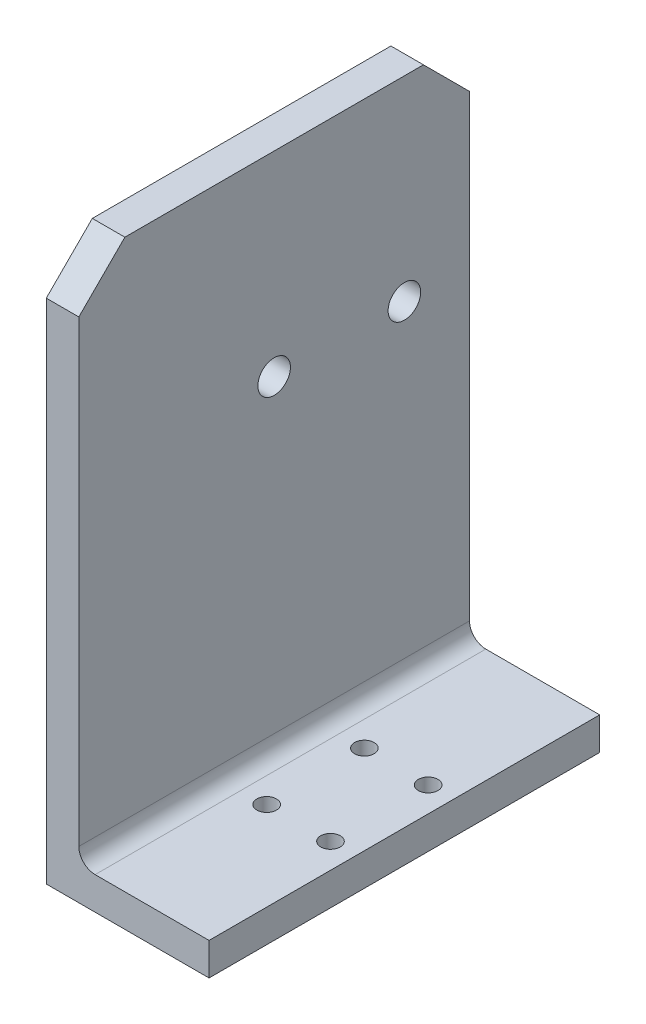
ISO-10303-21;
HEADER;
FILE_DESCRIPTION(('STEP AP214'),'2;1');
FILE_NAME('part.step','',(''),(''),'','','');
FILE_SCHEMA(('AUTOMOTIVE_DESIGN { 1 0 10303 214 1 1 1 1 }'));
ENDSEC;
DATA;
#1=APPLICATION_CONTEXT('core data for automotive mechanical design processes');
#2=APPLICATION_PROTOCOL_DEFINITION('international standard','automotive_design',2000,#1);
#3=PRODUCT_CONTEXT('',#1,'mechanical');
#4=PRODUCT('Part','Part','',(#3));
#5=PRODUCT_RELATED_PRODUCT_CATEGORY('part','',(#4));
#6=PRODUCT_DEFINITION_FORMATION('','',#4);
#7=PRODUCT_DEFINITION_CONTEXT('part definition',#1,'design');
#8=PRODUCT_DEFINITION('design','',#6,#7);
#9=PRODUCT_DEFINITION_SHAPE('','',#8);
#10=(LENGTH_UNIT() NAMED_UNIT(*) SI_UNIT(.MILLI.,.METRE.));
#11=(NAMED_UNIT(*) PLANE_ANGLE_UNIT() SI_UNIT($,.RADIAN.));
#12=(NAMED_UNIT(*) SI_UNIT($,.STERADIAN.) SOLID_ANGLE_UNIT());
#13=UNCERTAINTY_MEASURE_WITH_UNIT(LENGTH_MEASURE(1.E-05),#10,'distance_accuracy_value','');
#14=(GEOMETRIC_REPRESENTATION_CONTEXT(3) GLOBAL_UNCERTAINTY_ASSIGNED_CONTEXT((#13)) GLOBAL_UNIT_ASSIGNED_CONTEXT((#10,
#11,#12)) REPRESENTATION_CONTEXT('',''));
#15=CARTESIAN_POINT('',(0.,0.,0.));
#16=DIRECTION('',(0.,0.,1.));
#17=DIRECTION('',(1.,0.,0.));
#18=AXIS2_PLACEMENT_3D('',#15,#16,#17);
#19=CARTESIAN_POINT('',(12.5,5.,-30.));
#20=DIRECTION('',(-1.,0.,0.));
#21=DIRECTION('',(0.,0.,1.));
#22=AXIS2_PLACEMENT_3D('',#19,#20,#21);
#23=PLANE('',#22);
#24=DIRECTION('',(0.,0.,-1.));
#25=VECTOR('',#24,1.);
#26=CARTESIAN_POINT('',(12.5,0.,-30.));
#27=LINE('',#26,#25);
#28=CARTESIAN_POINT('',(12.5,0.,30.));
#29=VERTEX_POINT('',#28);
#30=CARTESIAN_POINT('',(12.5,0.,-30.));
#31=VERTEX_POINT('',#30);
#32=EDGE_CURVE('E126',#29,#31,#27,.T.);
#33=ORIENTED_EDGE('',*,*,#32,.T.);
#34=DIRECTION('',(0.,-1.,0.));
#35=VECTOR('',#34,1.);
#36=CARTESIAN_POINT('',(12.5,5.,-30.));
#37=LINE('',#36,#35);
#38=CARTESIAN_POINT('',(12.5,5.,-30.));
#39=VERTEX_POINT('',#38);
#40=EDGE_CURVE('E156',#39,#31,#37,.T.);
#41=ORIENTED_EDGE('',*,*,#40,.F.);
#42=DIRECTION('',(0.,0.,-1.));
#43=VECTOR('',#42,1.);
#44=CARTESIAN_POINT('',(12.5,5.,-30.));
#45=LINE('',#44,#43);
#46=CARTESIAN_POINT('',(12.5,5.,30.));
#47=VERTEX_POINT('',#46);
#48=EDGE_CURVE('E135',#47,#39,#45,.T.);
#49=ORIENTED_EDGE('',*,*,#48,.F.);
#50=DIRECTION('',(0.,-1.,0.));
#51=VECTOR('',#50,1.);
#52=CARTESIAN_POINT('',(12.5,5.,30.));
#53=LINE('',#52,#51);
#54=EDGE_CURVE('E142',#47,#29,#53,.T.);
#55=ORIENTED_EDGE('',*,*,#54,.T.);
#56=EDGE_LOOP('',(#33,#41,#49,#55));
#57=FACE_BOUND('',#56,.T.);
#58=ADVANCED_FACE('F33',(#57),#23,.F.);
#59=CARTESIAN_POINT('',(-12.5,5.,-30.));
#60=DIRECTION('',(0.,0.,1.));
#61=DIRECTION('',(1.,0.,0.));
#62=AXIS2_PLACEMENT_3D('',#59,#60,#61);
#63=PLANE('',#62);
#64=DIRECTION('',(0.,-1.,0.));
#65=VECTOR('',#64,1.);
#66=CARTESIAN_POINT('',(-12.5,5.,-30.));
#67=LINE('',#66,#65);
#68=CARTESIAN_POINT('',(-12.5,77.9289321881345,-30.));
#69=VERTEX_POINT('',#68);
#70=CARTESIAN_POINT('',(-12.5,0.,-30.));
#71=VERTEX_POINT('',#70);
#72=EDGE_CURVE('E154',#69,#71,#67,.T.);
#73=ORIENTED_EDGE('',*,*,#72,.F.);
#74=DIRECTION('',(1.,0.,0.));
#75=VECTOR('',#74,1.);
#76=CARTESIAN_POINT('',(-12.501,77.9289321881345,-30.));
#77=LINE('',#76,#75);
#78=CARTESIAN_POINT('',(-7.5,77.9289321881345,-30.));
#79=VERTEX_POINT('',#78);
#80=EDGE_CURVE('E166',#69,#79,#77,.T.);
#81=ORIENTED_EDGE('',*,*,#80,.T.);
#82=DIRECTION('',(0.,-1.,0.));
#83=VECTOR('',#82,1.);
#84=CARTESIAN_POINT('',(-7.5,85.,-30.));
#85=LINE('',#84,#83);
#86=CARTESIAN_POINT('',(-7.5,7.49999999999999,-30.));
#87=VERTEX_POINT('',#86);
#88=EDGE_CURVE('E127',#79,#87,#85,.T.);
#89=ORIENTED_EDGE('',*,*,#88,.T.);
#90=CARTESIAN_POINT('',(-5.,7.49999999999999,-30.));
#91=DIRECTION('',(0.,0.,1.));
#92=DIRECTION('',(1.,0.,0.));
#93=AXIS2_PLACEMENT_3D('',#90,#91,#92);
#94=CIRCLE('',#93,2.5);
#95=CARTESIAN_POINT('',(-5.,5.,-30.));
#96=VERTEX_POINT('',#95);
#97=EDGE_CURVE('E41',#87,#96,#94,.T.);
#98=ORIENTED_EDGE('',*,*,#97,.T.);
#99=DIRECTION('',(-1.,0.,0.));
#100=VECTOR('',#99,1.);
#101=CARTESIAN_POINT('',(-12.5,5.,-30.));
#102=LINE('',#101,#100);
#103=EDGE_CURVE('E138',#39,#96,#102,.T.);
#104=ORIENTED_EDGE('',*,*,#103,.F.);
#105=ORIENTED_EDGE('',*,*,#40,.T.);
#106=DIRECTION('',(-1.,0.,0.));
#107=VECTOR('',#106,1.);
#108=CARTESIAN_POINT('',(-12.5,0.,-30.));
#109=LINE('',#108,#107);
#110=EDGE_CURVE('E130',#31,#71,#109,.T.);
#111=ORIENTED_EDGE('',*,*,#110,.T.);
#112=EDGE_LOOP('',(#73,#81,#89,#98,#104,#105,#111));
#113=FACE_BOUND('',#112,.T.);
#114=ADVANCED_FACE('F165',(#113),#63,.F.);
#115=CARTESIAN_POINT('',(-12.5,5.,-30.));
#116=DIRECTION('',(1.,0.,0.));
#117=DIRECTION('',(0.,0.,-1.));
#118=AXIS2_PLACEMENT_3D('',#115,#116,#117);
#119=PLANE('',#118);
#120=CARTESIAN_POINT('',(-12.5,55.,-20.));
#121=DIRECTION('',(1.,0.,0.));
#122=DIRECTION('',(0.,0.,1.));
#123=AXIS2_PLACEMENT_3D('',#120,#121,#122);
#124=CIRCLE('',#123,2.5);
#125=CARTESIAN_POINT('',(-12.5,55.,-17.5));
#126=VERTEX_POINT('',#125);
#127=EDGE_CURVE('E216',#126,#126,#124,.T.);
#128=ORIENTED_EDGE('',*,*,#127,.T.);
#129=EDGE_LOOP('',(#128));
#130=FACE_BOUND('',#129,.T.);
#131=CARTESIAN_POINT('',(-12.5,55.,0.));
#132=DIRECTION('',(1.,0.,0.));
#133=DIRECTION('',(0.,0.,-1.));
#134=AXIS2_PLACEMENT_3D('',#131,#132,#133);
#135=CIRCLE('',#134,2.5);
#136=CARTESIAN_POINT('',(-12.5,55.,-2.5));
#137=VERTEX_POINT('',#136);
#138=EDGE_CURVE('E180',#137,#137,#135,.F.);
#139=ORIENTED_EDGE('',*,*,#138,.F.);
#140=EDGE_LOOP('',(#139));
#141=FACE_BOUND('',#140,.T.);
#142=DIRECTION('',(0.,-1.,0.));
#143=VECTOR('',#142,1.);
#144=CARTESIAN_POINT('',(-12.5,5.,30.));
#145=LINE('',#144,#143);
#146=CARTESIAN_POINT('',(-12.5,77.9289321881345,30.));
#147=VERTEX_POINT('',#146);
#148=CARTESIAN_POINT('',(-12.5,0.,30.));
#149=VERTEX_POINT('',#148);
#150=EDGE_CURVE('E152',#147,#149,#145,.T.);
#151=ORIENTED_EDGE('',*,*,#150,.F.);
#152=DIRECTION('',(0.,-0.707106781186551,0.707106781186544));
#153=VECTOR('',#152,1.);
#154=CARTESIAN_POINT('',(-12.5,77.9289321881345,30.));
#155=LINE('',#154,#153);
#156=CARTESIAN_POINT('',(-12.5,85.,22.9289321881346));
#157=VERTEX_POINT('',#156);
#158=EDGE_CURVE('E107',#157,#147,#155,.T.);
#159=ORIENTED_EDGE('',*,*,#158,.F.);
#160=DIRECTION('',(0.,0.,1.));
#161=VECTOR('',#160,1.);
#162=CARTESIAN_POINT('',(-12.5,85.,-30.));
#163=LINE('',#162,#161);
#164=CARTESIAN_POINT('',(-12.5,85.,-22.9289321881345));
#165=VERTEX_POINT('',#164);
#166=EDGE_CURVE('E183',#165,#157,#163,.T.);
#167=ORIENTED_EDGE('',*,*,#166,.F.);
#168=DIRECTION('',(0.,0.707106781186546,0.707106781186549));
#169=VECTOR('',#168,1.);
#170=CARTESIAN_POINT('',(-12.5,85.,-22.9289321881345));
#171=LINE('',#170,#169);
#172=EDGE_CURVE('E169',#69,#165,#171,.T.);
#173=ORIENTED_EDGE('',*,*,#172,.F.);
#174=ORIENTED_EDGE('',*,*,#72,.T.);
#175=DIRECTION('',(0.,0.,1.));
#176=VECTOR('',#175,1.);
#177=CARTESIAN_POINT('',(-12.5,0.,-30.));
#178=LINE('',#177,#176);
#179=EDGE_CURVE('E146',#71,#149,#178,.T.);
#180=ORIENTED_EDGE('',*,*,#179,.T.);
#181=EDGE_LOOP('',(#151,#159,#167,#173,#174,#180));
#182=FACE_BOUND('',#181,.T.);
#183=ADVANCED_FACE('F223',(#130,#141,#182),#119,.F.);
#184=CARTESIAN_POINT('',(-12.5,5.,30.));
#185=DIRECTION('',(0.,0.,-1.));
#186=DIRECTION('',(-1.,0.,0.));
#187=AXIS2_PLACEMENT_3D('',#184,#185,#186);
#188=PLANE('',#187);
#189=DIRECTION('',(0.,-1.,0.));
#190=VECTOR('',#189,1.);
#191=CARTESIAN_POINT('',(-7.5,85.,30.));
#192=LINE('',#191,#190);
#193=CARTESIAN_POINT('',(-7.5,77.9289321881345,30.));
#194=VERTEX_POINT('',#193);
#195=CARTESIAN_POINT('',(-7.5,7.49999999999999,30.));
#196=VERTEX_POINT('',#195);
#197=EDGE_CURVE('E118',#194,#196,#192,.T.);
#198=ORIENTED_EDGE('',*,*,#197,.F.);
#199=DIRECTION('',(1.,0.,0.));
#200=VECTOR('',#199,1.);
#201=CARTESIAN_POINT('',(-12.501,77.9289321881345,30.));
#202=LINE('',#201,#200);
#203=EDGE_CURVE('E101',#147,#194,#202,.T.);
#204=ORIENTED_EDGE('',*,*,#203,.F.);
#205=ORIENTED_EDGE('',*,*,#150,.T.);
#206=DIRECTION('',(1.,0.,0.));
#207=VECTOR('',#206,1.);
#208=CARTESIAN_POINT('',(-12.5,0.,30.));
#209=LINE('',#208,#207);
#210=EDGE_CURVE('E139',#149,#29,#209,.T.);
#211=ORIENTED_EDGE('',*,*,#210,.T.);
#212=ORIENTED_EDGE('',*,*,#54,.F.);
#213=DIRECTION('',(1.,0.,0.));
#214=VECTOR('',#213,1.);
#215=CARTESIAN_POINT('',(-12.5,5.,30.));
#216=LINE('',#215,#214);
#217=CARTESIAN_POINT('',(-5.,5.,30.));
#218=VERTEX_POINT('',#217);
#219=EDGE_CURVE('E141',#218,#47,#216,.T.);
#220=ORIENTED_EDGE('',*,*,#219,.F.);
#221=CARTESIAN_POINT('',(-5.,7.49999999999999,30.));
#222=DIRECTION('',(0.,0.,-1.));
#223=DIRECTION('',(-1.,0.,0.));
#224=AXIS2_PLACEMENT_3D('',#221,#222,#223);
#225=CIRCLE('',#224,2.5);
#226=EDGE_CURVE('E11',#218,#196,#225,.T.);
#227=ORIENTED_EDGE('',*,*,#226,.T.);
#228=EDGE_LOOP('',(#198,#204,#205,#211,#212,#220,#227));
#229=FACE_BOUND('',#228,.T.);
#230=ADVANCED_FACE('F124',(#229),#188,.F.);
#231=CARTESIAN_POINT('',(0.,5.,0.));
#232=DIRECTION('',(0.,1.,0.));
#233=DIRECTION('',(0.,0.,1.));
#234=AXIS2_PLACEMENT_3D('',#231,#232,#233);
#235=PLANE('',#234);
#236=CARTESIAN_POINT('',(8.65,5.,7.5));
#237=DIRECTION('',(0.,1.,0.));
#238=DIRECTION('',(0.,0.,1.));
#239=AXIS2_PLACEMENT_3D('',#236,#237,#238);
#240=CIRCLE('',#239,1.49999999999999);
#241=CARTESIAN_POINT('',(8.65,5.,8.99999999999999));
#242=VERTEX_POINT('',#241);
#243=EDGE_CURVE('E213',#242,#242,#240,.T.);
#244=ORIENTED_EDGE('',*,*,#243,.F.);
#245=EDGE_LOOP('',(#244));
#246=FACE_BOUND('',#245,.T.);
#247=CARTESIAN_POINT('',(8.65,5.,-7.5));
#248=DIRECTION('',(0.,1.,0.));
#249=DIRECTION('',(0.,0.,1.));
#250=AXIS2_PLACEMENT_3D('',#247,#248,#249);
#251=CIRCLE('',#250,1.49999999999999);
#252=CARTESIAN_POINT('',(8.65,5.,-6.00000000000001));
#253=VERTEX_POINT('',#252);
#254=EDGE_CURVE('E207',#253,#253,#251,.T.);
#255=ORIENTED_EDGE('',*,*,#254,.F.);
#256=EDGE_LOOP('',(#255));
#257=FACE_BOUND('',#256,.T.);
#258=CARTESIAN_POINT('',(-1.15,5.,7.5));
#259=DIRECTION('',(0.,1.,0.));
#260=DIRECTION('',(0.,0.,1.));
#261=AXIS2_PLACEMENT_3D('',#258,#259,#260);
#262=CIRCLE('',#261,1.49999999999999);
#263=CARTESIAN_POINT('',(-1.15,5.,8.99999999999999));
#264=VERTEX_POINT('',#263);
#265=EDGE_CURVE('E201',#264,#264,#262,.T.);
#266=ORIENTED_EDGE('',*,*,#265,.F.);
#267=EDGE_LOOP('',(#266));
#268=FACE_BOUND('',#267,.T.);
#269=CARTESIAN_POINT('',(-1.15,5.,-7.5));
#270=DIRECTION('',(0.,1.,0.));
#271=DIRECTION('',(0.,0.,1.));
#272=AXIS2_PLACEMENT_3D('',#269,#270,#271);
#273=CIRCLE('',#272,1.49999999999999);
#274=CARTESIAN_POINT('',(-1.15,5.,-6.00000000000001));
#275=VERTEX_POINT('',#274);
#276=EDGE_CURVE('E195',#275,#275,#273,.T.);
#277=ORIENTED_EDGE('',*,*,#276,.F.);
#278=EDGE_LOOP('',(#277));
#279=FACE_BOUND('',#278,.T.);
#280=ORIENTED_EDGE('',*,*,#103,.T.);
#281=DIRECTION('',(0.,0.,-1.));
#282=VECTOR('',#281,1.);
#283=CARTESIAN_POINT('',(-5.,5.,0.));
#284=LINE('',#283,#282);
#285=EDGE_CURVE('E54',#96,#218,#284,.F.);
#286=ORIENTED_EDGE('',*,*,#285,.T.);
#287=ORIENTED_EDGE('',*,*,#219,.T.);
#288=ORIENTED_EDGE('',*,*,#48,.T.);
#289=EDGE_LOOP('',(#280,#286,#287,#288));
#290=FACE_BOUND('',#289,.T.);
#291=ADVANCED_FACE('F261',(#246,#257,#268,#279,#290),#235,.T.);
#292=CARTESIAN_POINT('',(0.,0.,0.));
#293=DIRECTION('',(0.,1.,0.));
#294=DIRECTION('',(0.,0.,1.));
#295=AXIS2_PLACEMENT_3D('',#292,#293,#294);
#296=PLANE('',#295);
#297=CARTESIAN_POINT('',(8.65,0.,7.5));
#298=DIRECTION('',(0.,1.,0.));
#299=DIRECTION('',(0.,0.,1.));
#300=AXIS2_PLACEMENT_3D('',#297,#298,#299);
#301=CIRCLE('',#300,1.5);
#302=CARTESIAN_POINT('',(8.65,0.,9.));
#303=VERTEX_POINT('',#302);
#304=EDGE_CURVE('E210',#303,#303,#301,.T.);
#305=ORIENTED_EDGE('',*,*,#304,.T.);
#306=EDGE_LOOP('',(#305));
#307=FACE_BOUND('',#306,.T.);
#308=CARTESIAN_POINT('',(8.65,0.,-7.5));
#309=DIRECTION('',(0.,1.,0.));
#310=DIRECTION('',(0.,0.,1.));
#311=AXIS2_PLACEMENT_3D('',#308,#309,#310);
#312=CIRCLE('',#311,1.5);
#313=CARTESIAN_POINT('',(8.65,0.,-6.));
#314=VERTEX_POINT('',#313);
#315=EDGE_CURVE('E204',#314,#314,#312,.T.);
#316=ORIENTED_EDGE('',*,*,#315,.T.);
#317=EDGE_LOOP('',(#316));
#318=FACE_BOUND('',#317,.T.);
#319=CARTESIAN_POINT('',(-1.15,0.,7.5));
#320=DIRECTION('',(0.,1.,0.));
#321=DIRECTION('',(0.,0.,1.));
#322=AXIS2_PLACEMENT_3D('',#319,#320,#321);
#323=CIRCLE('',#322,1.5);
#324=CARTESIAN_POINT('',(-1.15,0.,9.));
#325=VERTEX_POINT('',#324);
#326=EDGE_CURVE('E198',#325,#325,#323,.T.);
#327=ORIENTED_EDGE('',*,*,#326,.T.);
#328=EDGE_LOOP('',(#327));
#329=FACE_BOUND('',#328,.T.);
#330=CARTESIAN_POINT('',(-1.15,0.,-7.5));
#331=DIRECTION('',(0.,1.,0.));
#332=DIRECTION('',(0.,0.,1.));
#333=AXIS2_PLACEMENT_3D('',#330,#331,#332);
#334=CIRCLE('',#333,1.5);
#335=CARTESIAN_POINT('',(-1.15,0.,-6.));
#336=VERTEX_POINT('',#335);
#337=EDGE_CURVE('E192',#336,#336,#334,.T.);
#338=ORIENTED_EDGE('',*,*,#337,.T.);
#339=EDGE_LOOP('',(#338));
#340=FACE_BOUND('',#339,.T.);
#341=ORIENTED_EDGE('',*,*,#32,.F.);
#342=ORIENTED_EDGE('',*,*,#210,.F.);
#343=ORIENTED_EDGE('',*,*,#179,.F.);
#344=ORIENTED_EDGE('',*,*,#110,.F.);
#345=EDGE_LOOP('',(#341,#342,#343,#344));
#346=FACE_BOUND('',#345,.T.);
#347=ADVANCED_FACE('F235',(#307,#318,#329,#340,#346),#296,.F.);
#348=CARTESIAN_POINT('',(-7.5,85.,-30.));
#349=DIRECTION('',(-1.,0.,0.));
#350=DIRECTION('',(0.,0.,1.));
#351=AXIS2_PLACEMENT_3D('',#348,#349,#350);
#352=PLANE('',#351);
#353=CARTESIAN_POINT('',(-7.5,55.,-20.));
#354=DIRECTION('',(1.,0.,0.));
#355=DIRECTION('',(0.,0.,1.));
#356=AXIS2_PLACEMENT_3D('',#353,#354,#355);
#357=CIRCLE('',#356,2.5);
#358=CARTESIAN_POINT('',(-7.5,55.,-17.5));
#359=VERTEX_POINT('',#358);
#360=EDGE_CURVE('E217',#359,#359,#357,.T.);
#361=ORIENTED_EDGE('',*,*,#360,.F.);
#362=EDGE_LOOP('',(#361));
#363=FACE_BOUND('',#362,.T.);
#364=CARTESIAN_POINT('',(-7.5,55.,0.));
#365=DIRECTION('',(1.,0.,0.));
#366=DIRECTION('',(0.,0.,-1.));
#367=AXIS2_PLACEMENT_3D('',#364,#365,#366);
#368=CIRCLE('',#367,2.5);
#369=CARTESIAN_POINT('',(-7.5,55.,-2.5));
#370=VERTEX_POINT('',#369);
#371=EDGE_CURVE('E177',#370,#370,#368,.T.);
#372=ORIENTED_EDGE('',*,*,#371,.F.);
#373=EDGE_LOOP('',(#372));
#374=FACE_BOUND('',#373,.T.);
#375=ORIENTED_EDGE('',*,*,#197,.T.);
#376=DIRECTION('',(0.,0.,-1.));
#377=VECTOR('',#376,1.);
#378=CARTESIAN_POINT('',(-7.5,7.49999999999999,-30.));
#379=LINE('',#378,#377);
#380=EDGE_CURVE('E159',#196,#87,#379,.T.);
#381=ORIENTED_EDGE('',*,*,#380,.T.);
#382=ORIENTED_EDGE('',*,*,#88,.F.);
#383=DIRECTION('',(0.,-0.707106781186546,-0.707106781186549));
#384=VECTOR('',#383,1.);
#385=CARTESIAN_POINT('',(-7.5,85.,-22.9289321881345));
#386=LINE('',#385,#384);
#387=CARTESIAN_POINT('',(-7.5,85.,-22.9289321881345));
#388=VERTEX_POINT('',#387);
#389=EDGE_CURVE('E173',#388,#79,#386,.T.);
#390=ORIENTED_EDGE('',*,*,#389,.F.);
#391=DIRECTION('',(0.,0.,-1.));
#392=VECTOR('',#391,1.);
#393=CARTESIAN_POINT('',(-7.5,85.,-30.));
#394=LINE('',#393,#392);
#395=CARTESIAN_POINT('',(-7.5,85.,22.9289321881346));
#396=VERTEX_POINT('',#395);
#397=EDGE_CURVE('E122',#396,#388,#394,.T.);
#398=ORIENTED_EDGE('',*,*,#397,.F.);
#399=DIRECTION('',(0.,0.707106781186551,-0.707106781186544));
#400=VECTOR('',#399,1.);
#401=CARTESIAN_POINT('',(-7.5,77.9289321881345,30.));
#402=LINE('',#401,#400);
#403=EDGE_CURVE('E104',#194,#396,#402,.T.);
#404=ORIENTED_EDGE('',*,*,#403,.F.);
#405=EDGE_LOOP('',(#375,#381,#382,#390,#398,#404));
#406=FACE_BOUND('',#405,.T.);
#407=ADVANCED_FACE('F116',(#363,#374,#406),#352,.F.);
#408=CARTESIAN_POINT('',(0.,85.,0.));
#409=DIRECTION('',(0.,1.,0.));
#410=DIRECTION('',(0.,0.,1.));
#411=AXIS2_PLACEMENT_3D('',#408,#409,#410);
#412=PLANE('',#411);
#413=DIRECTION('',(1.,0.,0.));
#414=VECTOR('',#413,1.);
#415=CARTESIAN_POINT('',(-12.501,85.,22.9289321881346));
#416=LINE('',#415,#414);
#417=EDGE_CURVE('E111',#157,#396,#416,.T.);
#418=ORIENTED_EDGE('',*,*,#417,.T.);
#419=ORIENTED_EDGE('',*,*,#397,.T.);
#420=DIRECTION('',(1.,0.,0.));
#421=VECTOR('',#420,1.);
#422=CARTESIAN_POINT('',(-12.501,85.,-22.9289321881345));
#423=LINE('',#422,#421);
#424=EDGE_CURVE('E170',#165,#388,#423,.T.);
#425=ORIENTED_EDGE('',*,*,#424,.F.);
#426=ORIENTED_EDGE('',*,*,#166,.T.);
#427=EDGE_LOOP('',(#418,#419,#425,#426));
#428=FACE_BOUND('',#427,.T.);
#429=ADVANCED_FACE('F187',(#428),#412,.T.);
#430=CARTESIAN_POINT('',(-19.5710678118655,55.,0.));
#431=DIRECTION('',(1.,0.,0.));
#432=DIRECTION('',(0.,0.,-1.));
#433=AXIS2_PLACEMENT_3D('',#430,#431,#432);
#434=CYLINDRICAL_SURFACE('',#433,2.5);
#435=ORIENTED_EDGE('',*,*,#138,.T.);
#436=EDGE_LOOP('',(#435));
#437=FACE_BOUND('',#436,.T.);
#438=ORIENTED_EDGE('',*,*,#371,.T.);
#439=EDGE_LOOP('',(#438));
#440=FACE_BOUND('',#439,.T.);
#441=ADVANCED_FACE('F239',(#437,#440),#434,.F.);
#442=CARTESIAN_POINT('',(-12.501,85.,-22.9289321881345));
#443=DIRECTION('',(0.,-0.707106781186549,0.707106781186546));
#444=DIRECTION('',(0.,-0.707106781186546,-0.707106781186549));
#445=AXIS2_PLACEMENT_3D('',#442,#443,#444);
#446=PLANE('',#445);
#447=ORIENTED_EDGE('',*,*,#172,.T.);
#448=ORIENTED_EDGE('',*,*,#424,.T.);
#449=ORIENTED_EDGE('',*,*,#389,.T.);
#450=ORIENTED_EDGE('',*,*,#80,.F.);
#451=EDGE_LOOP('',(#447,#448,#449,#450));
#452=FACE_BOUND('',#451,.T.);
#453=ADVANCED_FACE('F241',(#452),#446,.F.);
#454=CARTESIAN_POINT('',(-12.501,77.9289321881345,30.));
#455=DIRECTION('',(0.,-0.707106781186544,-0.707106781186551));
#456=DIRECTION('',(0.,0.707106781186551,-0.707106781186544));
#457=AXIS2_PLACEMENT_3D('',#454,#455,#456);
#458=PLANE('',#457);
#459=ORIENTED_EDGE('',*,*,#158,.T.);
#460=ORIENTED_EDGE('',*,*,#203,.T.);
#461=ORIENTED_EDGE('',*,*,#403,.T.);
#462=ORIENTED_EDGE('',*,*,#417,.F.);
#463=EDGE_LOOP('',(#459,#460,#461,#462));
#464=FACE_BOUND('',#463,.T.);
#465=ADVANCED_FACE('F103',(#464),#458,.F.);
#466=CARTESIAN_POINT('',(-5.,7.49999999999999,-30.));
#467=DIRECTION('',(0.,0.,-1.));
#468=DIRECTION('',(-1.,0.,0.));
#469=AXIS2_PLACEMENT_3D('',#466,#467,#468);
#470=CYLINDRICAL_SURFACE('',#469,2.5);
#471=ORIENTED_EDGE('',*,*,#226,.F.);
#472=ORIENTED_EDGE('',*,*,#285,.F.);
#473=ORIENTED_EDGE('',*,*,#97,.F.);
#474=ORIENTED_EDGE('',*,*,#380,.F.);
#475=EDGE_LOOP('',(#471,#472,#473,#474));
#476=FACE_BOUND('',#475,.T.);
#477=ADVANCED_FACE('F35',(#476),#470,.F.);
#478=CARTESIAN_POINT('',(-1.15,5.,-7.5));
#479=DIRECTION('',(0.,1.,0.));
#480=DIRECTION('',(0.,0.,1.));
#481=AXIS2_PLACEMENT_3D('',#478,#479,#480);
#482=CYLINDRICAL_SURFACE('',#481,1.49999999999999);
#483=ORIENTED_EDGE('',*,*,#337,.F.);
#484=EDGE_LOOP('',(#483));
#485=FACE_BOUND('',#484,.T.);
#486=ORIENTED_EDGE('',*,*,#276,.T.);
#487=EDGE_LOOP('',(#486));
#488=FACE_BOUND('',#487,.T.);
#489=ADVANCED_FACE('F279',(#485,#488),#482,.F.);
#490=CARTESIAN_POINT('',(-1.15,5.,7.5));
#491=DIRECTION('',(0.,1.,0.));
#492=DIRECTION('',(0.,0.,1.));
#493=AXIS2_PLACEMENT_3D('',#490,#491,#492);
#494=CYLINDRICAL_SURFACE('',#493,1.49999999999999);
#495=ORIENTED_EDGE('',*,*,#326,.F.);
#496=EDGE_LOOP('',(#495));
#497=FACE_BOUND('',#496,.T.);
#498=ORIENTED_EDGE('',*,*,#265,.T.);
#499=EDGE_LOOP('',(#498));
#500=FACE_BOUND('',#499,.T.);
#501=ADVANCED_FACE('F284',(#497,#500),#494,.F.);
#502=CARTESIAN_POINT('',(8.65,5.,-7.5));
#503=DIRECTION('',(0.,1.,0.));
#504=DIRECTION('',(0.,0.,1.));
#505=AXIS2_PLACEMENT_3D('',#502,#503,#504);
#506=CYLINDRICAL_SURFACE('',#505,1.49999999999999);
#507=ORIENTED_EDGE('',*,*,#315,.F.);
#508=EDGE_LOOP('',(#507));
#509=FACE_BOUND('',#508,.T.);
#510=ORIENTED_EDGE('',*,*,#254,.T.);
#511=EDGE_LOOP('',(#510));
#512=FACE_BOUND('',#511,.T.);
#513=ADVANCED_FACE('F293',(#509,#512),#506,.F.);
#514=CARTESIAN_POINT('',(8.65,5.,7.5));
#515=DIRECTION('',(0.,1.,0.));
#516=DIRECTION('',(0.,0.,1.));
#517=AXIS2_PLACEMENT_3D('',#514,#515,#516);
#518=CYLINDRICAL_SURFACE('',#517,1.49999999999999);
#519=ORIENTED_EDGE('',*,*,#304,.F.);
#520=EDGE_LOOP('',(#519));
#521=FACE_BOUND('',#520,.T.);
#522=ORIENTED_EDGE('',*,*,#243,.T.);
#523=EDGE_LOOP('',(#522));
#524=FACE_BOUND('',#523,.T.);
#525=ADVANCED_FACE('F229',(#521,#524),#518,.F.);
#526=CARTESIAN_POINT('',(-12.5,55.,-20.));
#527=DIRECTION('',(1.,0.,0.));
#528=DIRECTION('',(0.,0.,-1.));
#529=AXIS2_PLACEMENT_3D('',#526,#527,#528);
#530=CYLINDRICAL_SURFACE('',#529,2.5);
#531=ORIENTED_EDGE('',*,*,#127,.F.);
#532=EDGE_LOOP('',(#531));
#533=FACE_BOUND('',#532,.T.);
#534=ORIENTED_EDGE('',*,*,#360,.T.);
#535=EDGE_LOOP('',(#534));
#536=FACE_BOUND('',#535,.T.);
#537=ADVANCED_FACE('F226',(#533,#536),#530,.F.);
#538=CLOSED_SHELL('',(#58,#114,#183,#230,#291,#347,#407,#429,#441,#453,#465,#477,#489,#501,#513,
#525,#537));
#539=MANIFOLD_SOLID_BREP('B2',#538);
#540=ADVANCED_BREP_SHAPE_REPRESENTATION('',(#18,#539),#14);
#541=SHAPE_DEFINITION_REPRESENTATION(#9,#540);
ENDSEC;
END-ISO-10303-21;
